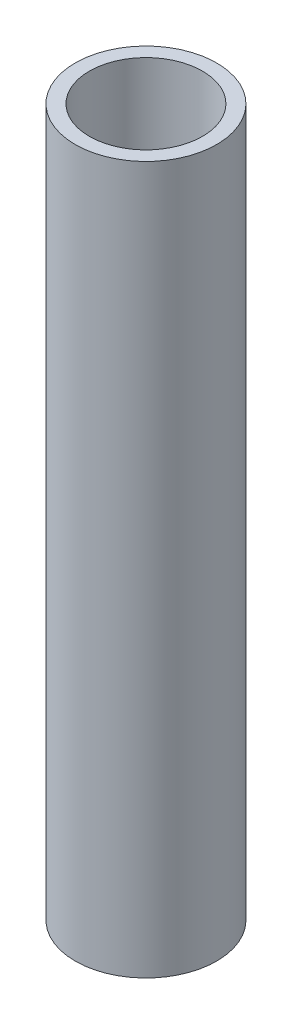
ISO-10303-21;
HEADER;
FILE_DESCRIPTION(('STEP AP214'),'2;1');
FILE_NAME('part.step','',(''),(''),'','','');
FILE_SCHEMA(('AUTOMOTIVE_DESIGN { 1 0 10303 214 1 1 1 1 }'));
ENDSEC;
DATA;
#1=APPLICATION_CONTEXT('core data for automotive mechanical design processes');
#2=APPLICATION_PROTOCOL_DEFINITION('international standard','automotive_design',2000,#1);
#3=PRODUCT_CONTEXT('',#1,'mechanical');
#4=PRODUCT('Part','Part','',(#3));
#5=PRODUCT_RELATED_PRODUCT_CATEGORY('part','',(#4));
#6=PRODUCT_DEFINITION_FORMATION('','',#4);
#7=PRODUCT_DEFINITION_CONTEXT('part definition',#1,'design');
#8=PRODUCT_DEFINITION('design','',#6,#7);
#9=PRODUCT_DEFINITION_SHAPE('','',#8);
#10=(LENGTH_UNIT() NAMED_UNIT(*) SI_UNIT(.MILLI.,.METRE.));
#11=(NAMED_UNIT(*) PLANE_ANGLE_UNIT() SI_UNIT($,.RADIAN.));
#12=(NAMED_UNIT(*) SI_UNIT($,.STERADIAN.) SOLID_ANGLE_UNIT());
#13=UNCERTAINTY_MEASURE_WITH_UNIT(LENGTH_MEASURE(1.E-05),#10,'distance_accuracy_value','');
#14=(GEOMETRIC_REPRESENTATION_CONTEXT(3) GLOBAL_UNCERTAINTY_ASSIGNED_CONTEXT((#13)) GLOBAL_UNIT_ASSIGNED_CONTEXT((#10,
#11,#12)) REPRESENTATION_CONTEXT('',''));
#15=CARTESIAN_POINT('',(0.,0.,0.));
#16=DIRECTION('',(0.,0.,1.));
#17=DIRECTION('',(1.,0.,0.));
#18=AXIS2_PLACEMENT_3D('',#15,#16,#17);
#19=CARTESIAN_POINT('',(0.,100.,0.));
#20=DIRECTION('',(0.,1.,0.));
#21=DIRECTION('',(0.,0.,1.));
#22=AXIS2_PLACEMENT_3D('',#19,#20,#21);
#23=PLANE('',#22);
#24=CARTESIAN_POINT('',(0.,100.,0.));
#25=DIRECTION('',(0.,1.,0.));
#26=DIRECTION('',(0.,0.,1.));
#27=AXIS2_PLACEMENT_3D('',#24,#25,#26);
#28=CIRCLE('',#27,10.);
#29=CARTESIAN_POINT('',(0.,100.,10.));
#30=VERTEX_POINT('',#29);
#31=EDGE_CURVE('E10',#30,#30,#28,.T.);
#32=ORIENTED_EDGE('',*,*,#31,.T.);
#33=EDGE_LOOP('',(#32));
#34=FACE_BOUND('',#33,.T.);
#35=CARTESIAN_POINT('',(0.,100.,0.));
#36=DIRECTION('',(0.,1.,0.));
#37=DIRECTION('',(0.,0.,1.));
#38=AXIS2_PLACEMENT_3D('',#35,#36,#37);
#39=CIRCLE('',#38,8.);
#40=CARTESIAN_POINT('',(0.,100.,8.));
#41=VERTEX_POINT('',#40);
#42=EDGE_CURVE('E48',#41,#41,#39,.T.);
#43=ORIENTED_EDGE('',*,*,#42,.F.);
#44=EDGE_LOOP('',(#43));
#45=FACE_BOUND('',#44,.T.);
#46=ADVANCED_FACE('F37',(#34,#45),#23,.T.);
#47=CARTESIAN_POINT('',(0.,0.,0.));
#48=DIRECTION('',(0.,1.,0.));
#49=DIRECTION('',(0.,0.,1.));
#50=AXIS2_PLACEMENT_3D('',#47,#48,#49);
#51=PLANE('',#50);
#52=CARTESIAN_POINT('',(0.,0.,0.));
#53=DIRECTION('',(0.,1.,0.));
#54=DIRECTION('',(0.,0.,1.));
#55=AXIS2_PLACEMENT_3D('',#52,#53,#54);
#56=CIRCLE('',#55,10.);
#57=CARTESIAN_POINT('',(0.,0.,10.));
#58=VERTEX_POINT('',#57);
#59=EDGE_CURVE('E41',#58,#58,#56,.T.);
#60=ORIENTED_EDGE('',*,*,#59,.F.);
#61=EDGE_LOOP('',(#60));
#62=FACE_BOUND('',#61,.T.);
#63=CARTESIAN_POINT('',(0.,0.,0.));
#64=DIRECTION('',(0.,1.,0.));
#65=DIRECTION('',(0.,0.,1.));
#66=AXIS2_PLACEMENT_3D('',#63,#64,#65);
#67=CIRCLE('',#66,8.);
#68=CARTESIAN_POINT('',(0.,0.,8.));
#69=VERTEX_POINT('',#68);
#70=EDGE_CURVE('E50',#69,#69,#67,.T.);
#71=ORIENTED_EDGE('',*,*,#70,.T.);
#72=EDGE_LOOP('',(#71));
#73=FACE_BOUND('',#72,.T.);
#74=ADVANCED_FACE('F60',(#62,#73),#51,.F.);
#75=CARTESIAN_POINT('',(0.,100.,0.));
#76=DIRECTION('',(0.,-1.,0.));
#77=DIRECTION('',(0.,0.,-1.));
#78=AXIS2_PLACEMENT_3D('',#75,#76,#77);
#79=CYLINDRICAL_SURFACE('',#78,10.);
#80=ORIENTED_EDGE('',*,*,#31,.F.);
#81=EDGE_LOOP('',(#80));
#82=FACE_BOUND('',#81,.T.);
#83=ORIENTED_EDGE('',*,*,#59,.T.);
#84=EDGE_LOOP('',(#83));
#85=FACE_BOUND('',#84,.T.);
#86=ADVANCED_FACE('F39',(#82,#85),#79,.T.);
#87=CARTESIAN_POINT('',(0.,100.,0.));
#88=DIRECTION('',(0.,-1.,0.));
#89=DIRECTION('',(0.,0.,-1.));
#90=AXIS2_PLACEMENT_3D('',#87,#88,#89);
#91=CYLINDRICAL_SURFACE('',#90,8.);
#92=ORIENTED_EDGE('',*,*,#42,.T.);
#93=EDGE_LOOP('',(#92));
#94=FACE_BOUND('',#93,.T.);
#95=ORIENTED_EDGE('',*,*,#70,.F.);
#96=EDGE_LOOP('',(#95));
#97=FACE_BOUND('',#96,.T.);
#98=ADVANCED_FACE('F56',(#94,#97),#91,.F.);
#99=CLOSED_SHELL('',(#46,#74,#86,#98));
#100=MANIFOLD_SOLID_BREP('B2',#99);
#101=ADVANCED_BREP_SHAPE_REPRESENTATION('',(#18,#100),#14);
#102=SHAPE_DEFINITION_REPRESENTATION(#9,#101);
ENDSEC;
END-ISO-10303-21;
